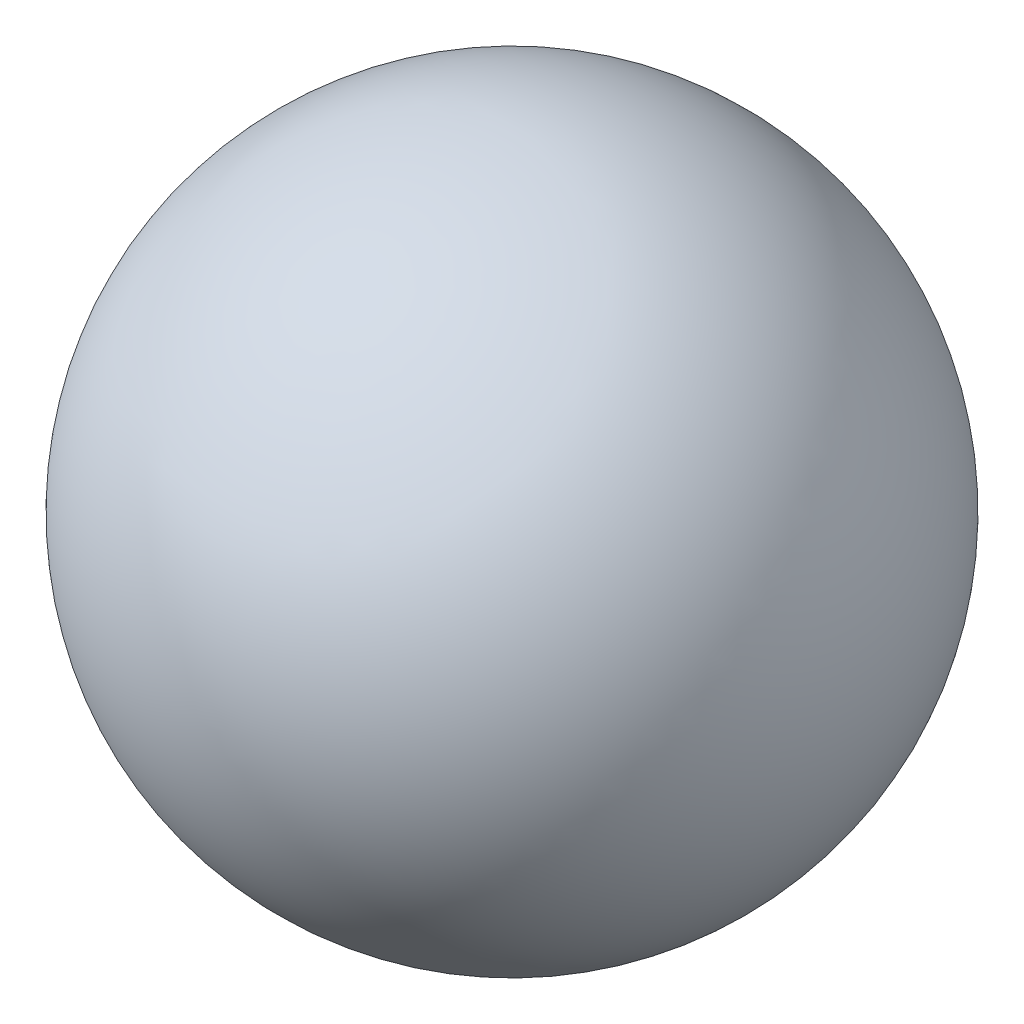
ISO-10303-21;
HEADER;
FILE_DESCRIPTION(('STEP AP214'),'2;1');
FILE_NAME('part.step','',(''),(''),'','','');
FILE_SCHEMA(('AUTOMOTIVE_DESIGN { 1 0 10303 214 1 1 1 1 }'));
ENDSEC;
DATA;
#1=APPLICATION_CONTEXT('core data for automotive mechanical design processes');
#2=APPLICATION_PROTOCOL_DEFINITION('international standard','automotive_design',2000,#1);
#3=PRODUCT_CONTEXT('',#1,'mechanical');
#4=PRODUCT('Part','Part','',(#3));
#5=PRODUCT_RELATED_PRODUCT_CATEGORY('part','',(#4));
#6=PRODUCT_DEFINITION_FORMATION('','',#4);
#7=PRODUCT_DEFINITION_CONTEXT('part definition',#1,'design');
#8=PRODUCT_DEFINITION('design','',#6,#7);
#9=PRODUCT_DEFINITION_SHAPE('','',#8);
#10=(LENGTH_UNIT() NAMED_UNIT(*) SI_UNIT(.MILLI.,.METRE.));
#11=(NAMED_UNIT(*) PLANE_ANGLE_UNIT() SI_UNIT($,.RADIAN.));
#12=(NAMED_UNIT(*) SI_UNIT($,.STERADIAN.) SOLID_ANGLE_UNIT());
#13=UNCERTAINTY_MEASURE_WITH_UNIT(LENGTH_MEASURE(1.E-05),#10,'distance_accuracy_value','');
#14=(GEOMETRIC_REPRESENTATION_CONTEXT(3) GLOBAL_UNCERTAINTY_ASSIGNED_CONTEXT((#13)) GLOBAL_UNIT_ASSIGNED_CONTEXT((#10,
#11,#12)) REPRESENTATION_CONTEXT('',''));
#15=CARTESIAN_POINT('',(0.,0.,0.));
#16=DIRECTION('',(0.,0.,1.));
#17=DIRECTION('',(1.,0.,0.));
#18=AXIS2_PLACEMENT_3D('',#15,#16,#17);
#19=CARTESIAN_POINT('',(57.535,45.3342224023532,-41.6044922024531));
#20=DIRECTION('',(0.,0.736764460517836,-0.676149487700658));
#21=DIRECTION('',(0.173648177666933,0.66587725768284,0.725571352861821));
#22=AXIS2_PLACEMENT_3D('',#19,#20,#21);
#23=SPHERICAL_SURFACE('',#22,6.75);
#24=CARTESIAN_POINT('',(57.535,40.3610622938578,-37.0404831604737));
#25=VERTEX_POINT('',#24);
#26=VERTEX_LOOP('',#25);
#27=FACE_BOUND('',#26,.T.);
#28=CARTESIAN_POINT('',(57.535,50.3073825108486,-46.1685012444325));
#29=VERTEX_POINT('',#28);
#30=VERTEX_LOOP('',#29);
#31=FACE_BOUND('',#30,.T.);
#32=ADVANCED_FACE('F16',(#27,#31),#23,.T.);
#33=CLOSED_SHELL('',(#32));
#34=MANIFOLD_SOLID_BREP('B1',#33);
#35=ADVANCED_BREP_SHAPE_REPRESENTATION('',(#18,#34),#14);
#36=SHAPE_DEFINITION_REPRESENTATION(#9,#35);
ENDSEC;
END-ISO-10303-21;
